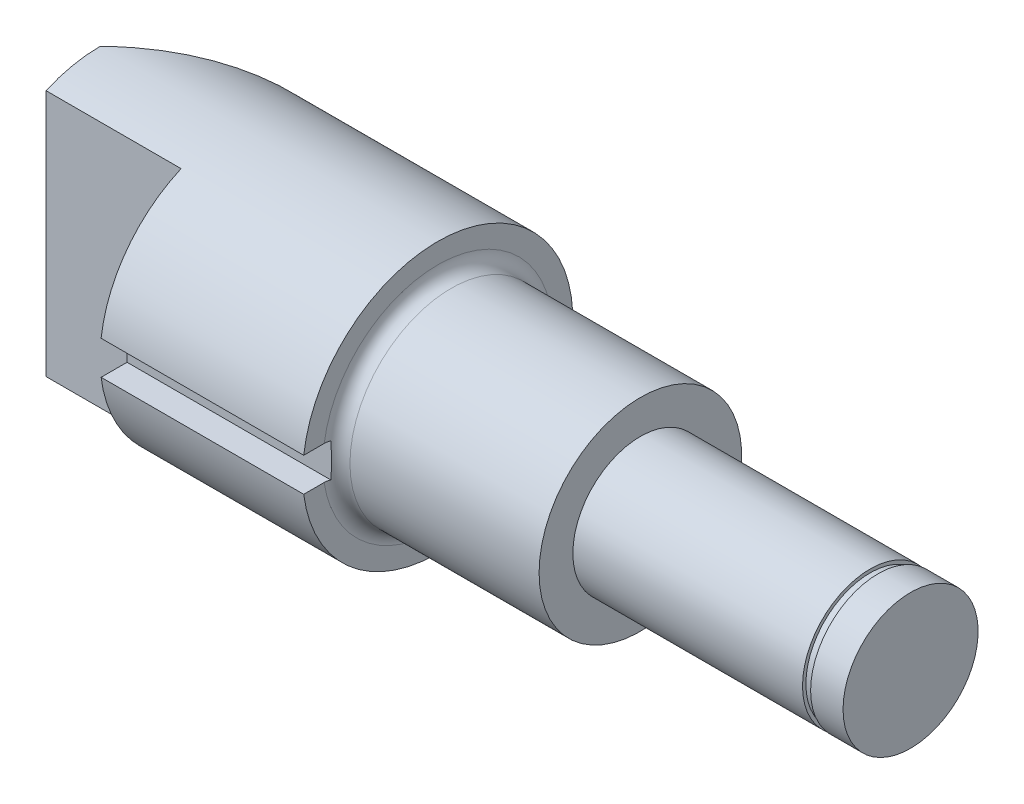
ISO-10303-21;
HEADER;
FILE_DESCRIPTION(('STEP AP214'),'2;1');
FILE_NAME('part.step','',(''),(''),'','','');
FILE_SCHEMA(('AUTOMOTIVE_DESIGN { 1 0 10303 214 1 1 1 1 }'));
ENDSEC;
DATA;
#1=APPLICATION_CONTEXT('core data for automotive mechanical design processes');
#2=APPLICATION_PROTOCOL_DEFINITION('international standard','automotive_design',2000,#1);
#3=PRODUCT_CONTEXT('',#1,'mechanical');
#4=PRODUCT('Part','Part','',(#3));
#5=PRODUCT_RELATED_PRODUCT_CATEGORY('part','',(#4));
#6=PRODUCT_DEFINITION_FORMATION('','',#4);
#7=PRODUCT_DEFINITION_CONTEXT('part definition',#1,'design');
#8=PRODUCT_DEFINITION('design','',#6,#7);
#9=PRODUCT_DEFINITION_SHAPE('','',#8);
#10=(LENGTH_UNIT() NAMED_UNIT(*) SI_UNIT(.MILLI.,.METRE.));
#11=(NAMED_UNIT(*) PLANE_ANGLE_UNIT() SI_UNIT($,.RADIAN.));
#12=(NAMED_UNIT(*) SI_UNIT($,.STERADIAN.) SOLID_ANGLE_UNIT());
#13=UNCERTAINTY_MEASURE_WITH_UNIT(LENGTH_MEASURE(1.E-05),#10,'distance_accuracy_value','');
#14=(GEOMETRIC_REPRESENTATION_CONTEXT(3) GLOBAL_UNCERTAINTY_ASSIGNED_CONTEXT((#13)) GLOBAL_UNIT_ASSIGNED_CONTEXT((#10,
#11,#12)) REPRESENTATION_CONTEXT('',''));
#15=CARTESIAN_POINT('',(0.,0.,0.));
#16=DIRECTION('',(0.,0.,1.));
#17=DIRECTION('',(1.,0.,0.));
#18=AXIS2_PLACEMENT_3D('',#15,#16,#17);
#19=CARTESIAN_POINT('',(120.,-84.8218275635599,0.));
#20=DIRECTION('',(1.,0.,0.));
#21=DIRECTION('',(0.,0.,-1.));
#22=AXIS2_PLACEMENT_3D('',#19,#20,#21);
#23=PLANE('',#22);
#24=CARTESIAN_POINT('',(120.,0.,0.));
#25=DIRECTION('',(-1.,0.,0.));
#26=DIRECTION('',(0.,0.,1.));
#27=AXIS2_PLACEMENT_3D('',#24,#25,#26);
#28=CIRCLE('',#27,9.99999999999999);
#29=CARTESIAN_POINT('',(120.,0.,9.99999999999999));
#30=VERTEX_POINT('',#29);
#31=EDGE_CURVE('E137',#30,#30,#28,.T.);
#32=ORIENTED_EDGE('',*,*,#31,.F.);
#33=EDGE_LOOP('',(#32));
#34=FACE_BOUND('',#33,.T.);
#35=ADVANCED_FACE('F32',(#34),#23,.T.);
#36=CARTESIAN_POINT('',(-17.2602276019036,0.,0.));
#37=DIRECTION('',(-1.,0.,0.));
#38=DIRECTION('',(0.,0.,1.));
#39=AXIS2_PLACEMENT_3D('',#36,#37,#38);
#40=CYLINDRICAL_SURFACE('',#39,9.99999999999999);
#41=ORIENTED_EDGE('',*,*,#31,.T.);
#42=EDGE_LOOP('',(#41));
#43=FACE_BOUND('',#42,.T.);
#44=CARTESIAN_POINT('',(115.2,0.,0.));
#45=DIRECTION('',(-1.,0.,0.));
#46=DIRECTION('',(0.,0.,1.));
#47=AXIS2_PLACEMENT_3D('',#44,#45,#46);
#48=CIRCLE('',#47,9.99999999999999);
#49=CARTESIAN_POINT('',(115.2,0.,9.99999999999999));
#50=VERTEX_POINT('',#49);
#51=EDGE_CURVE('E134',#50,#50,#48,.T.);
#52=ORIENTED_EDGE('',*,*,#51,.F.);
#53=EDGE_LOOP('',(#52));
#54=FACE_BOUND('',#53,.T.);
#55=ADVANCED_FACE('F218',(#43,#54),#40,.T.);
#56=CARTESIAN_POINT('',(115.2,-84.8218275635599,0.));
#57=DIRECTION('',(-1.,0.,0.));
#58=DIRECTION('',(0.,0.,1.));
#59=AXIS2_PLACEMENT_3D('',#56,#57,#58);
#60=PLANE('',#59);
#61=ORIENTED_EDGE('',*,*,#51,.T.);
#62=EDGE_LOOP('',(#61));
#63=FACE_BOUND('',#62,.T.);
#64=CARTESIAN_POINT('',(115.2,0.,0.));
#65=DIRECTION('',(-1.,0.,0.));
#66=DIRECTION('',(0.,0.,1.));
#67=AXIS2_PLACEMENT_3D('',#64,#65,#66);
#68=CIRCLE('',#67,9.49999999999999);
#69=CARTESIAN_POINT('',(115.2,0.,9.49999999999999));
#70=VERTEX_POINT('',#69);
#71=EDGE_CURVE('E131',#70,#70,#68,.T.);
#72=ORIENTED_EDGE('',*,*,#71,.F.);
#73=EDGE_LOOP('',(#72));
#74=FACE_BOUND('',#73,.T.);
#75=ADVANCED_FACE('F214',(#63,#74),#60,.T.);
#76=CARTESIAN_POINT('',(-17.2602276019036,0.,0.));
#77=DIRECTION('',(-1.,0.,0.));
#78=DIRECTION('',(0.,0.,1.));
#79=AXIS2_PLACEMENT_3D('',#76,#77,#78);
#80=CYLINDRICAL_SURFACE('',#79,9.49999999999999);
#81=ORIENTED_EDGE('',*,*,#71,.T.);
#82=EDGE_LOOP('',(#81));
#83=FACE_BOUND('',#82,.T.);
#84=CARTESIAN_POINT('',(114.,0.,0.));
#85=DIRECTION('',(-1.,0.,0.));
#86=DIRECTION('',(0.,0.,1.));
#87=AXIS2_PLACEMENT_3D('',#84,#85,#86);
#88=CIRCLE('',#87,9.49999999999999);
#89=CARTESIAN_POINT('',(114.,0.,9.49999999999999));
#90=VERTEX_POINT('',#89);
#91=EDGE_CURVE('E128',#90,#90,#88,.T.);
#92=ORIENTED_EDGE('',*,*,#91,.F.);
#93=EDGE_LOOP('',(#92));
#94=FACE_BOUND('',#93,.T.);
#95=ADVANCED_FACE('F210',(#83,#94),#80,.T.);
#96=CARTESIAN_POINT('',(114.,-84.8218275635599,0.));
#97=DIRECTION('',(1.,0.,0.));
#98=DIRECTION('',(0.,0.,-1.));
#99=AXIS2_PLACEMENT_3D('',#96,#97,#98);
#100=PLANE('',#99);
#101=ORIENTED_EDGE('',*,*,#91,.T.);
#102=EDGE_LOOP('',(#101));
#103=FACE_BOUND('',#102,.T.);
#104=CARTESIAN_POINT('',(114.,0.,0.));
#105=DIRECTION('',(-1.,0.,0.));
#106=DIRECTION('',(0.,0.,1.));
#107=AXIS2_PLACEMENT_3D('',#104,#105,#106);
#108=CIRCLE('',#107,9.99999999999999);
#109=CARTESIAN_POINT('',(114.,0.,9.99999999999999));
#110=VERTEX_POINT('',#109);
#111=EDGE_CURVE('E125',#110,#110,#108,.T.);
#112=ORIENTED_EDGE('',*,*,#111,.F.);
#113=EDGE_LOOP('',(#112));
#114=FACE_BOUND('',#113,.T.);
#115=ADVANCED_FACE('F206',(#103,#114),#100,.T.);
#116=CARTESIAN_POINT('',(-17.2602276019036,0.,0.));
#117=DIRECTION('',(-1.,0.,0.));
#118=DIRECTION('',(0.,0.,1.));
#119=AXIS2_PLACEMENT_3D('',#116,#117,#118);
#120=CYLINDRICAL_SURFACE('',#119,9.99999999999999);
#121=ORIENTED_EDGE('',*,*,#111,.T.);
#122=EDGE_LOOP('',(#121));
#123=FACE_BOUND('',#122,.T.);
#124=CARTESIAN_POINT('',(80.,0.,0.));
#125=DIRECTION('',(-1.,0.,0.));
#126=DIRECTION('',(0.,0.,1.));
#127=AXIS2_PLACEMENT_3D('',#124,#125,#126);
#128=CIRCLE('',#127,9.99999999999999);
#129=CARTESIAN_POINT('',(80.,0.,9.99999999999999));
#130=VERTEX_POINT('',#129);
#131=EDGE_CURVE('E122',#130,#130,#128,.T.);
#132=ORIENTED_EDGE('',*,*,#131,.F.);
#133=EDGE_LOOP('',(#132));
#134=FACE_BOUND('',#133,.T.);
#135=ADVANCED_FACE('F202',(#123,#134),#120,.T.);
#136=CARTESIAN_POINT('',(80.,-84.8218275635599,0.));
#137=DIRECTION('',(1.,0.,0.));
#138=DIRECTION('',(0.,0.,-1.));
#139=AXIS2_PLACEMENT_3D('',#136,#137,#138);
#140=PLANE('',#139);
#141=ORIENTED_EDGE('',*,*,#131,.T.);
#142=EDGE_LOOP('',(#141));
#143=FACE_BOUND('',#142,.T.);
#144=CARTESIAN_POINT('',(80.,0.,0.));
#145=DIRECTION('',(-1.,0.,0.));
#146=DIRECTION('',(0.,0.,1.));
#147=AXIS2_PLACEMENT_3D('',#144,#145,#146);
#148=CIRCLE('',#147,15.);
#149=CARTESIAN_POINT('',(80.,0.,15.));
#150=VERTEX_POINT('',#149);
#151=EDGE_CURVE('E114',#150,#150,#148,.T.);
#152=ORIENTED_EDGE('',*,*,#151,.F.);
#153=EDGE_LOOP('',(#152));
#154=FACE_BOUND('',#153,.T.);
#155=ADVANCED_FACE('F198',(#143,#154),#140,.T.);
#156=CARTESIAN_POINT('',(-17.2602276019036,0.,0.));
#157=DIRECTION('',(-1.,0.,0.));
#158=DIRECTION('',(0.,0.,1.));
#159=AXIS2_PLACEMENT_3D('',#156,#157,#158);
#160=CYLINDRICAL_SURFACE('',#159,15.);
#161=CARTESIAN_POINT('',(52.,0.,0.));
#162=DIRECTION('',(1.,0.,0.));
#163=DIRECTION('',(0.,0.,-1.));
#164=AXIS2_PLACEMENT_3D('',#161,#162,#163);
#165=CIRCLE('',#164,15.);
#166=CARTESIAN_POINT('',(52.,0.,-15.));
#167=VERTEX_POINT('',#166);
#168=EDGE_CURVE('E151',#167,#167,#165,.T.);
#169=ORIENTED_EDGE('',*,*,#168,.T.);
#170=EDGE_LOOP('',(#169));
#171=FACE_BOUND('',#170,.T.);
#172=ORIENTED_EDGE('',*,*,#151,.T.);
#173=EDGE_LOOP('',(#172));
#174=FACE_BOUND('',#173,.T.);
#175=ADVANCED_FACE('F194',(#171,#174),#160,.T.);
#176=CARTESIAN_POINT('',(50.,-84.8218275635599,0.));
#177=DIRECTION('',(1.,0.,0.));
#178=DIRECTION('',(0.,0.,-1.));
#179=AXIS2_PLACEMENT_3D('',#176,#177,#178);
#180=PLANE('',#179);
#181=DIRECTION('',(0.,0.,-1.));
#182=VECTOR('',#181,1.);
#183=CARTESIAN_POINT('',(50.,2.5,16.));
#184=LINE('',#183,#182);
#185=CARTESIAN_POINT('',(50.,2.5,19.8431348329844));
#186=VERTEX_POINT('',#185);
#187=CARTESIAN_POINT('',(50.,2.5,16.8151717208002));
#188=VERTEX_POINT('',#187);
#189=EDGE_CURVE('E361',#186,#188,#184,.T.);
#190=ORIENTED_EDGE('',*,*,#189,.T.);
#191=CARTESIAN_POINT('',(50.,0.,0.));
#192=DIRECTION('',(1.,0.,0.));
#193=DIRECTION('',(0.,0.,-1.));
#194=AXIS2_PLACEMENT_3D('',#191,#192,#193);
#195=CIRCLE('',#194,17.);
#196=CARTESIAN_POINT('',(50.,-2.5,16.8151717208002));
#197=VERTEX_POINT('',#196);
#198=EDGE_CURVE('E148',#188,#197,#195,.F.);
#199=ORIENTED_EDGE('',*,*,#198,.T.);
#200=DIRECTION('',(0.,0.,1.));
#201=VECTOR('',#200,1.);
#202=CARTESIAN_POINT('',(50.,-2.5,16.));
#203=LINE('',#202,#201);
#204=CARTESIAN_POINT('',(50.,-2.5,19.8431348329844));
#205=VERTEX_POINT('',#204);
#206=EDGE_CURVE('E359',#197,#205,#203,.T.);
#207=ORIENTED_EDGE('',*,*,#206,.T.);
#208=CARTESIAN_POINT('',(50.,0.,0.));
#209=DIRECTION('',(-1.,0.,0.));
#210=DIRECTION('',(0.,0.,1.));
#211=AXIS2_PLACEMENT_3D('',#208,#209,#210);
#212=CIRCLE('',#211,20.);
#213=EDGE_CURVE('E111',#186,#205,#212,.T.);
#214=ORIENTED_EDGE('',*,*,#213,.F.);
#215=EDGE_LOOP('',(#190,#199,#207,#214));
#216=FACE_BOUND('',#215,.T.);
#217=ADVANCED_FACE('F191',(#216),#180,.T.);
#218=CARTESIAN_POINT('',(-17.2602276019036,0.,0.));
#219=DIRECTION('',(-1.,0.,0.));
#220=DIRECTION('',(0.,0.,1.));
#221=AXIS2_PLACEMENT_3D('',#218,#219,#220);
#222=CYLINDRICAL_SURFACE('',#221,20.);
#223=CARTESIAN_POINT('',(0.,0.,0.));
#224=DIRECTION('',(0.707106781186549,0.,0.707106781186546));
#225=DIRECTION('',(-0.707106781186546,0.,0.707106781186549));
#226=AXIS2_PLACEMENT_3D('',#223,#224,#225);
#227=ELLIPSE('',#226,28.2842712474618,20.);
#228=CARTESIAN_POINT('',(0.,20.,0.));
#229=VERTEX_POINT('',#228);
#230=CARTESIAN_POINT('',(0.,-20.,0.));
#231=VERTEX_POINT('',#230);
#232=EDGE_CURVE('E46',#229,#231,#227,.F.);
#233=ORIENTED_EDGE('',*,*,#232,.F.);
#234=CARTESIAN_POINT('',(0.,0.,0.));
#235=DIRECTION('',(-1.,0.,0.));
#236=DIRECTION('',(0.,0.,1.));
#237=AXIS2_PLACEMENT_3D('',#234,#235,#236);
#238=CIRCLE('',#237,20.);
#239=CARTESIAN_POINT('',(0.,18.3303027798234,8.));
#240=VERTEX_POINT('',#239);
#241=EDGE_CURVE('E102',#240,#229,#238,.T.);
#242=ORIENTED_EDGE('',*,*,#241,.F.);
#243=DIRECTION('',(-1.,0.,0.));
#244=VECTOR('',#243,1.);
#245=CARTESIAN_POINT('',(-17.2602276019036,18.3303027798234,8.));
#246=LINE('',#245,#244);
#247=CARTESIAN_POINT('',(20.,18.3303027798234,8.));
#248=VERTEX_POINT('',#247);
#249=EDGE_CURVE('E378',#248,#240,#246,.T.);
#250=ORIENTED_EDGE('',*,*,#249,.F.);
#251=CARTESIAN_POINT('',(20.,0.,0.));
#252=DIRECTION('',(1.,0.,0.));
#253=DIRECTION('',(0.,0.,-1.));
#254=AXIS2_PLACEMENT_3D('',#251,#252,#253);
#255=CIRCLE('',#254,20.);
#256=CARTESIAN_POINT('',(20.,2.5,19.8431348329844));
#257=VERTEX_POINT('',#256);
#258=EDGE_CURVE('E141',#257,#248,#255,.F.);
#259=ORIENTED_EDGE('',*,*,#258,.F.);
#260=DIRECTION('',(-1.,0.,0.));
#261=VECTOR('',#260,1.);
#262=CARTESIAN_POINT('',(-17.2602276019036,2.5,19.8431348329844));
#263=LINE('',#262,#261);
#264=EDGE_CURVE('E374',#186,#257,#263,.T.);
#265=ORIENTED_EDGE('',*,*,#264,.F.);
#266=ORIENTED_EDGE('',*,*,#213,.T.);
#267=DIRECTION('',(-1.,0.,0.));
#268=VECTOR('',#267,1.);
#269=CARTESIAN_POINT('',(-17.2602276019036,-2.5,19.8431348329844));
#270=LINE('',#269,#268);
#271=CARTESIAN_POINT('',(20.,-2.5,19.8431348329844));
#272=VERTEX_POINT('',#271);
#273=EDGE_CURVE('E363',#272,#205,#270,.F.);
#274=ORIENTED_EDGE('',*,*,#273,.F.);
#275=CARTESIAN_POINT('',(20.,-18.3303027798234,8.));
#276=VERTEX_POINT('',#275);
#277=EDGE_CURVE('E142',#276,#272,#255,.F.);
#278=ORIENTED_EDGE('',*,*,#277,.F.);
#279=DIRECTION('',(-1.,0.,0.));
#280=VECTOR('',#279,1.);
#281=CARTESIAN_POINT('',(-17.2602276019036,-18.3303027798234,8.));
#282=LINE('',#281,#280);
#283=CARTESIAN_POINT('',(0.,-18.3303027798234,8.));
#284=VERTEX_POINT('',#283);
#285=EDGE_CURVE('E116',#284,#276,#282,.F.);
#286=ORIENTED_EDGE('',*,*,#285,.F.);
#287=EDGE_CURVE('E104',#231,#284,#238,.T.);
#288=ORIENTED_EDGE('',*,*,#287,.F.);
#289=EDGE_LOOP('',(#233,#242,#250,#259,#265,#266,#274,#278,#286,#288));
#290=FACE_BOUND('',#289,.T.);
#291=ADVANCED_FACE('F100',(#290),#222,.T.);
#292=CARTESIAN_POINT('',(0.,-84.8218275635599,0.));
#293=DIRECTION('',(-1.,0.,0.));
#294=DIRECTION('',(0.,0.,1.));
#295=AXIS2_PLACEMENT_3D('',#292,#293,#294);
#296=PLANE('',#295);
#297=DIRECTION('',(0.,1.,0.));
#298=VECTOR('',#297,1.);
#299=CARTESIAN_POINT('',(0.,-84.8218275635599,0.));
#300=LINE('',#299,#298);
#301=EDGE_CURVE('E11',#231,#229,#300,.T.);
#302=ORIENTED_EDGE('',*,*,#301,.F.);
#303=ORIENTED_EDGE('',*,*,#287,.T.);
#304=DIRECTION('',(0.,-1.,0.));
#305=VECTOR('',#304,1.);
#306=CARTESIAN_POINT('',(0.,-84.8218275635599,8.));
#307=LINE('',#306,#305);
#308=EDGE_CURVE('E110',#240,#284,#307,.T.);
#309=ORIENTED_EDGE('',*,*,#308,.F.);
#310=ORIENTED_EDGE('',*,*,#241,.T.);
#311=EDGE_LOOP('',(#302,#303,#309,#310));
#312=FACE_BOUND('',#311,.T.);
#313=ADVANCED_FACE('F108',(#312),#296,.T.);
#314=CARTESIAN_POINT('',(20.,-50.,8.));
#315=DIRECTION('',(1.,0.,0.));
#316=DIRECTION('',(0.,0.,-1.));
#317=AXIS2_PLACEMENT_3D('',#314,#315,#316);
#318=PLANE('',#317);
#319=DIRECTION('',(0.,-1.,0.));
#320=VECTOR('',#319,1.);
#321=CARTESIAN_POINT('',(20.,2.5,16.));
#322=LINE('',#321,#320);
#323=CARTESIAN_POINT('',(20.,2.5,16.));
#324=VERTEX_POINT('',#323);
#325=CARTESIAN_POINT('',(20.,-2.5,16.));
#326=VERTEX_POINT('',#325);
#327=EDGE_CURVE('E105',#324,#326,#322,.T.);
#328=ORIENTED_EDGE('',*,*,#327,.F.);
#329=DIRECTION('',(0.,0.,1.));
#330=VECTOR('',#329,1.);
#331=CARTESIAN_POINT('',(20.,2.5,8.));
#332=LINE('',#331,#330);
#333=EDGE_CURVE('E145',#324,#257,#332,.T.);
#334=ORIENTED_EDGE('',*,*,#333,.T.);
#335=ORIENTED_EDGE('',*,*,#258,.T.);
#336=DIRECTION('',(0.,1.,0.));
#337=VECTOR('',#336,1.);
#338=CARTESIAN_POINT('',(20.,-50.,8.));
#339=LINE('',#338,#337);
#340=EDGE_CURVE('E376',#276,#248,#339,.T.);
#341=ORIENTED_EDGE('',*,*,#340,.F.);
#342=ORIENTED_EDGE('',*,*,#277,.T.);
#343=DIRECTION('',(0.,0.,1.));
#344=VECTOR('',#343,1.);
#345=CARTESIAN_POINT('',(20.,-2.5,16.));
#346=LINE('',#345,#344);
#347=EDGE_CURVE('E364',#326,#272,#346,.T.);
#348=ORIENTED_EDGE('',*,*,#347,.F.);
#349=EDGE_LOOP('',(#328,#334,#335,#341,#342,#348));
#350=FACE_BOUND('',#349,.T.);
#351=ADVANCED_FACE('F182',(#350),#318,.F.);
#352=CARTESIAN_POINT('',(20.,-50.,8.));
#353=DIRECTION('',(0.,0.,-1.));
#354=DIRECTION('',(-1.,0.,0.));
#355=AXIS2_PLACEMENT_3D('',#352,#353,#354);
#356=PLANE('',#355);
#357=ORIENTED_EDGE('',*,*,#285,.T.);
#358=ORIENTED_EDGE('',*,*,#340,.T.);
#359=ORIENTED_EDGE('',*,*,#249,.T.);
#360=ORIENTED_EDGE('',*,*,#308,.T.);
#361=EDGE_LOOP('',(#357,#358,#359,#360));
#362=FACE_BOUND('',#361,.T.);
#363=ADVANCED_FACE('F178',(#362),#356,.F.);
#364=CARTESIAN_POINT('',(50.,2.5,16.));
#365=DIRECTION('',(0.,0.,-1.));
#366=DIRECTION('',(-1.,0.,0.));
#367=AXIS2_PLACEMENT_3D('',#364,#365,#366);
#368=PLANE('',#367);
#369=ORIENTED_EDGE('',*,*,#327,.T.);
#370=DIRECTION('',(-1.,0.,0.));
#371=VECTOR('',#370,1.);
#372=CARTESIAN_POINT('',(50.,-2.5,16.));
#373=LINE('',#372,#371);
#374=CARTESIAN_POINT('',(50.1695407177826,-2.5,16.));
#375=VERTEX_POINT('',#374);
#376=EDGE_CURVE('E366',#375,#326,#373,.T.);
#377=ORIENTED_EDGE('',*,*,#376,.F.);
#378=CARTESIAN_POINT('',(50.1695407177826,-2.5,16.));
#379=CARTESIAN_POINT('',(50.1808934789947,-2.33321231611843,16.));
#380=CARTESIAN_POINT('',(50.1917576006921,-2.16638522934921,16.));
#381=CARTESIAN_POINT('',(50.2119005154471,-1.83261875113716,16.));
#382=CARTESIAN_POINT('',(50.2211791418276,-1.66567934973684,16.));
#383=CARTESIAN_POINT('',(50.2375404361347,-1.33168853152133,16.));
#384=CARTESIAN_POINT('',(50.2446230876091,-1.16463711387631,16.));
#385=CARTESIAN_POINT('',(50.2561382922366,-0.830447599352328,16.));
#386=CARTESIAN_POINT('',(50.2605709470454,-0.663309506044517,16.));
#387=CARTESIAN_POINT('',(50.2664862910918,-0.32932866234446,16.));
#388=CARTESIAN_POINT('',(50.2679751145655,-0.162486023136669,16.));
#389=CARTESIAN_POINT('',(50.2679225852291,0.171198775146252,16.));
#390=CARTESIAN_POINT('',(50.2663812324416,0.338040934221388,16.));
#391=CARTESIAN_POINT('',(50.260371216038,0.67165627542091,16.));
#392=CARTESIAN_POINT('',(50.2559028150058,0.838429462389991,16.));
#393=CARTESIAN_POINT('',(50.2443320387498,1.17188148777616,16.));
#394=CARTESIAN_POINT('',(50.2372296843122,1.33856032692742,16.));
#395=CARTESIAN_POINT('',(50.2249652900478,1.58811235151081,16.));
#396=CARTESIAN_POINT('',(50.220620594361,1.67102712252974,16.));
#397=CARTESIAN_POINT('',(50.2114635389646,1.83682972345396,16.));
#398=CARTESIAN_POINT('',(50.2066511859842,1.91971755372969,16.));
#399=CARTESIAN_POINT('',(50.1966306188452,2.08551586041741,16.));
#400=CARTESIAN_POINT('',(50.1914221835276,2.16842632333985,16.));
#401=CARTESIAN_POINT('',(50.1806941954002,2.33422721698213,16.));
#402=CARTESIAN_POINT('',(50.1751746424161,2.41711764769072,16.));
#403=CARTESIAN_POINT('',(50.1695407177816,2.49999999999995,16.));
#404=B_SPLINE_CURVE_WITH_KNOTS('',3,(#378,#379,#380,#381,#382,#383,#384,#385,#386,#387,#388,
#389,#390,#391,#392,#393,#394,#395,#396,#397,#398,#399,#400,#401,#402,#403),.UNSPECIFIED.,.F.,
.F.,(4,2,2,2,2,2,2,2,2,2,2,2,4),(0.,0.501529646006978,1.00311198351073,1.50469807875369,
2.00626493158531,2.50678553374771,3.00730613218992,3.50778183536641,4.00825358903684,
4.25733813295189,4.5064190933365,4.75564016801978,5.00486138244166),.UNSPECIFIED.);
#405=CARTESIAN_POINT('',(50.1695407177826,2.5,16.));
#406=VERTEX_POINT('',#405);
#407=EDGE_CURVE('E161',#375,#406,#404,.T.);
#408=ORIENTED_EDGE('',*,*,#407,.T.);
#409=DIRECTION('',(-1.,0.,0.));
#410=VECTOR('',#409,1.);
#411=CARTESIAN_POINT('',(50.,2.5,16.));
#412=LINE('',#411,#410);
#413=EDGE_CURVE('E54',#406,#324,#412,.T.);
#414=ORIENTED_EDGE('',*,*,#413,.T.);
#415=EDGE_LOOP('',(#369,#377,#408,#414));
#416=FACE_BOUND('',#415,.T.);
#417=ADVANCED_FACE('F174',(#416),#368,.F.);
#418=CARTESIAN_POINT('',(50.,2.5,16.));
#419=DIRECTION('',(0.,1.,0.));
#420=DIRECTION('',(0.,0.,1.));
#421=AXIS2_PLACEMENT_3D('',#418,#419,#420);
#422=PLANE('',#421);
#423=ORIENTED_EDGE('',*,*,#264,.T.);
#424=ORIENTED_EDGE('',*,*,#333,.F.);
#425=ORIENTED_EDGE('',*,*,#413,.F.);
#426=CARTESIAN_POINT('',(50.1695407177826,2.5,16.));
#427=CARTESIAN_POINT('',(50.146424395825,2.5,16.0531286212491));
#428=CARTESIAN_POINT('',(50.1255839889289,2.5,16.1072461907913));
#429=CARTESIAN_POINT('',(50.0885686211066,2.5,16.2170711462066));
#430=CARTESIAN_POINT('',(50.0723949682815,2.5,16.272778973033));
#431=CARTESIAN_POINT('',(50.0450728916364,2.5,16.3844137886095));
#432=CARTESIAN_POINT('',(50.0338440808291,2.5,16.4403211252534));
#433=CARTESIAN_POINT('',(50.016097041369,2.5,16.5528563073344));
#434=CARTESIAN_POINT('',(50.0095768833769,2.5,16.6094838479831));
#435=CARTESIAN_POINT('',(50.0018099146895,2.5,16.7158264359792));
#436=CARTESIAN_POINT('',(49.9999959493425,2.5,16.7655006114675));
#437=CARTESIAN_POINT('',(50.,2.5,16.8151717208002));
#438=B_SPLINE_CURVE_WITH_KNOTS('',3,(#426,#427,#428,#429,#430,#431,#432,#433,#434,#435,#436,
#437),.UNSPECIFIED.,.F.,.F.,(4,2,2,2,2,4),(0.,0.173765416051602,0.347579491711485,
0.518453005477699,0.689256465167869,0.838244805215069),.UNSPECIFIED.);
#439=EDGE_CURVE('E41',#406,#188,#438,.T.);
#440=ORIENTED_EDGE('',*,*,#439,.T.);
#441=ORIENTED_EDGE('',*,*,#189,.F.);
#442=EDGE_LOOP('',(#423,#424,#425,#440,#441));
#443=FACE_BOUND('',#442,.T.);
#444=ADVANCED_FACE('F170',(#443),#422,.F.);
#445=CARTESIAN_POINT('',(50.,-2.5,16.));
#446=DIRECTION('',(0.,-1.,0.));
#447=DIRECTION('',(0.,0.,-1.));
#448=AXIS2_PLACEMENT_3D('',#445,#446,#447);
#449=PLANE('',#448);
#450=ORIENTED_EDGE('',*,*,#273,.T.);
#451=ORIENTED_EDGE('',*,*,#206,.F.);
#452=CARTESIAN_POINT('',(50.,-2.5,16.8151717208002));
#453=CARTESIAN_POINT('',(49.9999938486154,-2.5,16.7572326468738));
#454=CARTESIAN_POINT('',(50.0024629277476,-2.5,16.6992940079616));
#455=CARTESIAN_POINT('',(50.0123063742793,-2.5,16.5838169778828));
#456=CARTESIAN_POINT('',(50.0196822361122,-2.5,16.5262787140526));
#457=CARTESIAN_POINT('',(50.0391279170161,-2.5,16.4130052143046));
#458=CARTESIAN_POINT('',(50.051116107005,-2.5,16.3572559463878));
#459=CARTESIAN_POINT('',(50.0797024092944,-2.5,16.2469755973151));
#460=CARTESIAN_POINT('',(50.0962985835243,-2.5,16.1924440144087));
#461=CARTESIAN_POINT('',(50.1315781367357,-2.5,16.0918244054987));
#462=CARTESIAN_POINT('',(50.1497243050316,-2.5,16.0455474308355));
#463=CARTESIAN_POINT('',(50.1695407177826,-2.5,16.));
#464=B_SPLINE_CURVE_WITH_KNOTS('',3,(#452,#453,#454,#455,#456,#457,#458,#459,#460,#461,#462,
#463),.UNSPECIFIED.,.F.,.F.,(4,2,2,2,2,4),(0.,0.173764388361519,0.347581723486569,
0.518454703963357,0.689255925613916,0.838244858914482),.UNSPECIFIED.);
#465=EDGE_CURVE('E154',#197,#375,#464,.T.);
#466=ORIENTED_EDGE('',*,*,#465,.T.);
#467=ORIENTED_EDGE('',*,*,#376,.T.);
#468=ORIENTED_EDGE('',*,*,#347,.T.);
#469=EDGE_LOOP('',(#450,#451,#466,#467,#468));
#470=FACE_BOUND('',#469,.T.);
#471=ADVANCED_FACE('F166',(#470),#449,.F.);
#472=CARTESIAN_POINT('',(52.,0.,0.));
#473=DIRECTION('',(1.,0.,0.));
#474=DIRECTION('',(0.,0.,-1.));
#475=AXIS2_PLACEMENT_3D('',#472,#473,#474);
#476=TOROIDAL_SURFACE('',#475,17.,2.);
#477=ORIENTED_EDGE('',*,*,#168,.F.);
#478=EDGE_LOOP('',(#477));
#479=FACE_BOUND('',#478,.T.);
#480=ORIENTED_EDGE('',*,*,#465,.F.);
#481=ORIENTED_EDGE('',*,*,#198,.F.);
#482=ORIENTED_EDGE('',*,*,#439,.F.);
#483=ORIENTED_EDGE('',*,*,#407,.F.);
#484=EDGE_LOOP('',(#480,#481,#482,#483));
#485=FACE_BOUND('',#484,.T.);
#486=ADVANCED_FACE('F34',(#479,#485),#476,.F.);
#487=CARTESIAN_POINT('',(0.,-50.,0.));
#488=DIRECTION('',(0.707106781186549,0.,0.707106781186546));
#489=DIRECTION('',(0.707106781186546,0.,-0.707106781186549));
#490=AXIS2_PLACEMENT_3D('',#487,#488,#489);
#491=PLANE('',#490);
#492=ORIENTED_EDGE('',*,*,#232,.T.);
#493=ORIENTED_EDGE('',*,*,#301,.T.);
#494=EDGE_LOOP('',(#492,#493));
#495=FACE_BOUND('',#494,.T.);
#496=ADVANCED_FACE('F94',(#495),#491,.F.);
#497=CLOSED_SHELL('',(#35,#55,#75,#95,#115,#135,#155,#175,#217,#291,#313,#351,#363,#417,#444,
#471,#486,#496));
#498=MANIFOLD_SOLID_BREP('B2',#497);
#499=ADVANCED_BREP_SHAPE_REPRESENTATION('',(#18,#498),#14);
#500=SHAPE_DEFINITION_REPRESENTATION(#9,#499);
ENDSEC;
END-ISO-10303-21;
